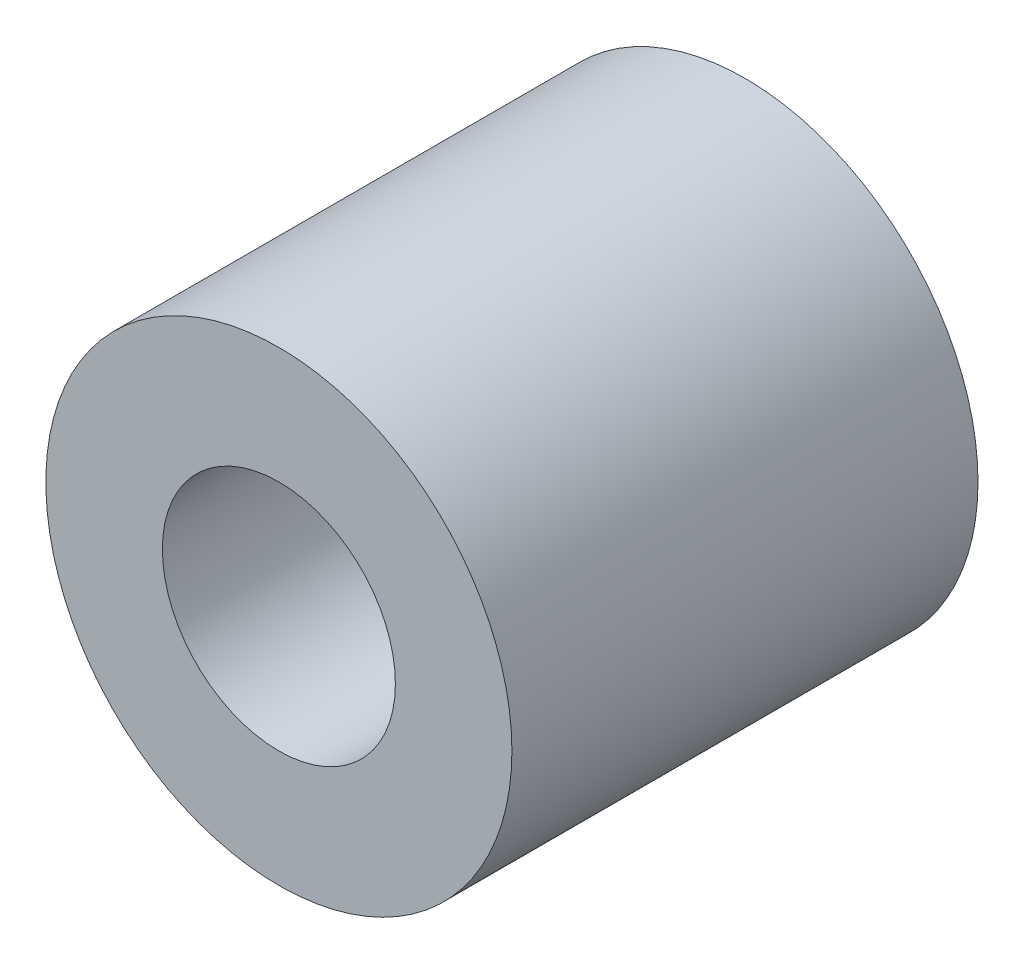
ISO-10303-21;
HEADER;
FILE_DESCRIPTION(('STEP AP214'),'2;1');
FILE_NAME('part.step','',(''),(''),'','','');
FILE_SCHEMA(('AUTOMOTIVE_DESIGN { 1 0 10303 214 1 1 1 1 }'));
ENDSEC;
DATA;
#1=APPLICATION_CONTEXT('core data for automotive mechanical design processes');
#2=APPLICATION_PROTOCOL_DEFINITION('international standard','automotive_design',2000,#1);
#3=PRODUCT_CONTEXT('',#1,'mechanical');
#4=PRODUCT('Part','Part','',(#3));
#5=PRODUCT_RELATED_PRODUCT_CATEGORY('part','',(#4));
#6=PRODUCT_DEFINITION_FORMATION('','',#4);
#7=PRODUCT_DEFINITION_CONTEXT('part definition',#1,'design');
#8=PRODUCT_DEFINITION('design','',#6,#7);
#9=PRODUCT_DEFINITION_SHAPE('','',#8);
#10=(LENGTH_UNIT() NAMED_UNIT(*) SI_UNIT(.MILLI.,.METRE.));
#11=(NAMED_UNIT(*) PLANE_ANGLE_UNIT() SI_UNIT($,.RADIAN.));
#12=(NAMED_UNIT(*) SI_UNIT($,.STERADIAN.) SOLID_ANGLE_UNIT());
#13=UNCERTAINTY_MEASURE_WITH_UNIT(LENGTH_MEASURE(1.E-05),#10,'distance_accuracy_value','');
#14=(GEOMETRIC_REPRESENTATION_CONTEXT(3) GLOBAL_UNCERTAINTY_ASSIGNED_CONTEXT((#13)) GLOBAL_UNIT_ASSIGNED_CONTEXT((#10,
#11,#12)) REPRESENTATION_CONTEXT('',''));
#15=CARTESIAN_POINT('',(0.,0.,0.));
#16=DIRECTION('',(0.,0.,1.));
#17=DIRECTION('',(1.,0.,0.));
#18=AXIS2_PLACEMENT_3D('',#15,#16,#17);
#19=CARTESIAN_POINT('',(16.35,-29.65,27.));
#20=DIRECTION('',(0.,0.,-1.));
#21=DIRECTION('',(-1.,0.,0.));
#22=AXIS2_PLACEMENT_3D('',#19,#20,#21);
#23=CYLINDRICAL_SURFACE('',#22,6.);
#24=CARTESIAN_POINT('',(16.35,-29.65,27.));
#25=DIRECTION('',(0.,0.,1.));
#26=DIRECTION('',(1.,0.,0.));
#27=AXIS2_PLACEMENT_3D('',#24,#25,#26);
#28=CIRCLE('',#27,6.);
#29=CARTESIAN_POINT('',(22.35,-29.65,27.));
#30=VERTEX_POINT('',#29);
#31=EDGE_CURVE('E11',#30,#30,#28,.T.);
#32=ORIENTED_EDGE('',*,*,#31,.F.);
#33=EDGE_LOOP('',(#32));
#34=FACE_BOUND('',#33,.T.);
#35=CARTESIAN_POINT('',(16.35,-29.65,15.));
#36=DIRECTION('',(0.,0.,1.));
#37=DIRECTION('',(1.,0.,0.));
#38=AXIS2_PLACEMENT_3D('',#35,#36,#37);
#39=CIRCLE('',#38,6.);
#40=CARTESIAN_POINT('',(22.35,-29.65,15.));
#41=VERTEX_POINT('',#40);
#42=EDGE_CURVE('E35',#41,#41,#39,.T.);
#43=ORIENTED_EDGE('',*,*,#42,.T.);
#44=EDGE_LOOP('',(#43));
#45=FACE_BOUND('',#44,.T.);
#46=ADVANCED_FACE('F32',(#34,#45),#23,.T.);
#47=CARTESIAN_POINT('',(16.35,-29.65,27.));
#48=DIRECTION('',(0.,0.,1.));
#49=DIRECTION('',(1.,0.,0.));
#50=AXIS2_PLACEMENT_3D('',#47,#48,#49);
#51=PLANE('',#50);
#52=CARTESIAN_POINT('',(16.35,-29.65,27.));
#53=DIRECTION('',(0.,0.,1.));
#54=DIRECTION('',(1.,0.,0.));
#55=AXIS2_PLACEMENT_3D('',#52,#53,#54);
#56=CIRCLE('',#55,3.);
#57=CARTESIAN_POINT('',(19.35,-29.65,27.));
#58=VERTEX_POINT('',#57);
#59=EDGE_CURVE('E69',#58,#58,#56,.T.);
#60=ORIENTED_EDGE('',*,*,#59,.F.);
#61=EDGE_LOOP('',(#60));
#62=FACE_BOUND('',#61,.T.);
#63=ORIENTED_EDGE('',*,*,#31,.T.);
#64=EDGE_LOOP('',(#63));
#65=FACE_BOUND('',#64,.T.);
#66=ADVANCED_FACE('F99',(#62,#65),#51,.T.);
#67=CARTESIAN_POINT('',(16.35,-29.65,15.));
#68=DIRECTION('',(0.,0.,1.));
#69=DIRECTION('',(1.,0.,0.));
#70=AXIS2_PLACEMENT_3D('',#67,#68,#69);
#71=PLANE('',#70);
#72=DIRECTION('',(0.,-1.,0.));
#73=VECTOR('',#72,1.);
#74=CARTESIAN_POINT('',(18.35,-32.0185438564654,15.));
#75=LINE('',#74,#73);
#76=CARTESIAN_POINT('',(18.35,-27.2814561435346,15.));
#77=VERTEX_POINT('',#76);
#78=CARTESIAN_POINT('',(18.35,-32.0185438564654,15.));
#79=VERTEX_POINT('',#78);
#80=EDGE_CURVE('E93',#77,#79,#75,.T.);
#81=ORIENTED_EDGE('',*,*,#80,.F.);
#82=CARTESIAN_POINT('',(16.35,-29.65,15.));
#83=DIRECTION('',(0.,0.,-1.));
#84=DIRECTION('',(-1.,0.,0.));
#85=AXIS2_PLACEMENT_3D('',#82,#83,#84);
#86=CIRCLE('',#85,3.1);
#87=EDGE_CURVE('E53',#79,#77,#86,.T.);
#88=ORIENTED_EDGE('',*,*,#87,.F.);
#89=EDGE_LOOP('',(#81,#88));
#90=FACE_BOUND('',#89,.T.);
#91=ORIENTED_EDGE('',*,*,#42,.F.);
#92=EDGE_LOOP('',(#91));
#93=FACE_BOUND('',#92,.T.);
#94=ADVANCED_FACE('F102',(#90,#93),#71,.F.);
#95=CARTESIAN_POINT('',(16.35,-29.65,21.));
#96=DIRECTION('',(0.,0.,-1.));
#97=DIRECTION('',(-1.,0.,0.));
#98=AXIS2_PLACEMENT_3D('',#95,#96,#97);
#99=CYLINDRICAL_SURFACE('',#98,3.1);
#100=ORIENTED_EDGE('',*,*,#87,.T.);
#101=DIRECTION('',(0.,0.,-1.));
#102=VECTOR('',#101,1.);
#103=CARTESIAN_POINT('',(18.35,-27.2814561435346,21.));
#104=LINE('',#103,#102);
#105=CARTESIAN_POINT('',(18.35,-27.2814561435346,21.));
#106=VERTEX_POINT('',#105);
#107=EDGE_CURVE('E88',#106,#77,#104,.T.);
#108=ORIENTED_EDGE('',*,*,#107,.F.);
#109=CARTESIAN_POINT('',(16.35,-29.65,21.));
#110=DIRECTION('',(0.,0.,-1.));
#111=DIRECTION('',(-1.,0.,0.));
#112=AXIS2_PLACEMENT_3D('',#109,#110,#111);
#113=CIRCLE('',#112,3.1);
#114=CARTESIAN_POINT('',(18.35,-32.0185438564654,21.));
#115=VERTEX_POINT('',#114);
#116=EDGE_CURVE('E87',#115,#106,#113,.T.);
#117=ORIENTED_EDGE('',*,*,#116,.F.);
#118=DIRECTION('',(0.,0.,-1.));
#119=VECTOR('',#118,1.);
#120=CARTESIAN_POINT('',(18.35,-32.0185438564654,21.));
#121=LINE('',#120,#119);
#122=EDGE_CURVE('E89',#115,#79,#121,.T.);
#123=ORIENTED_EDGE('',*,*,#122,.T.);
#124=EDGE_LOOP('',(#100,#108,#117,#123));
#125=FACE_BOUND('',#124,.T.);
#126=ADVANCED_FACE('F112',(#125),#99,.F.);
#127=CARTESIAN_POINT('',(18.35,-32.0185438564654,21.));
#128=DIRECTION('',(1.,0.,0.));
#129=DIRECTION('',(0.,1.,0.));
#130=AXIS2_PLACEMENT_3D('',#127,#128,#129);
#131=PLANE('',#130);
#132=ORIENTED_EDGE('',*,*,#80,.T.);
#133=ORIENTED_EDGE('',*,*,#122,.F.);
#134=DIRECTION('',(0.,-1.,0.));
#135=VECTOR('',#134,1.);
#136=CARTESIAN_POINT('',(18.35,-32.0185438564654,21.));
#137=LINE('',#136,#135);
#138=CARTESIAN_POINT('',(18.35,-31.8860679774998,21.));
#139=VERTEX_POINT('',#138);
#140=EDGE_CURVE('E82',#139,#115,#137,.T.);
#141=ORIENTED_EDGE('',*,*,#140,.F.);
#142=CARTESIAN_POINT('',(18.35,-27.4139320225002,21.));
#143=VERTEX_POINT('',#142);
#144=EDGE_CURVE('E66',#143,#139,#137,.T.);
#145=ORIENTED_EDGE('',*,*,#144,.F.);
#146=EDGE_CURVE('E80',#106,#143,#137,.T.);
#147=ORIENTED_EDGE('',*,*,#146,.F.);
#148=ORIENTED_EDGE('',*,*,#107,.T.);
#149=EDGE_LOOP('',(#132,#133,#141,#145,#147,#148));
#150=FACE_BOUND('',#149,.T.);
#151=ADVANCED_FACE('F79',(#150),#131,.F.);
#152=CARTESIAN_POINT('',(16.35,-29.65,21.));
#153=DIRECTION('',(0.,0.,-1.));
#154=DIRECTION('',(-1.,0.,0.));
#155=AXIS2_PLACEMENT_3D('',#152,#153,#154);
#156=PLANE('',#155);
#157=ORIENTED_EDGE('',*,*,#146,.T.);
#158=CARTESIAN_POINT('',(16.35,-29.65,21.));
#159=DIRECTION('',(0.,0.,1.));
#160=DIRECTION('',(1.,0.,0.));
#161=AXIS2_PLACEMENT_3D('',#158,#159,#160);
#162=CIRCLE('',#161,3.);
#163=EDGE_CURVE('E68',#143,#139,#162,.T.);
#164=ORIENTED_EDGE('',*,*,#163,.T.);
#165=ORIENTED_EDGE('',*,*,#140,.T.);
#166=ORIENTED_EDGE('',*,*,#116,.T.);
#167=EDGE_LOOP('',(#157,#164,#165,#166));
#168=FACE_BOUND('',#167,.T.);
#169=ADVANCED_FACE('F85',(#168),#156,.T.);
#170=CARTESIAN_POINT('',(16.35,-29.65,21.));
#171=DIRECTION('',(0.,0.,1.));
#172=DIRECTION('',(1.,0.,0.));
#173=AXIS2_PLACEMENT_3D('',#170,#171,#172);
#174=PLANE('',#173);
#175=ORIENTED_EDGE('',*,*,#144,.T.);
#176=EDGE_CURVE('E45',#139,#143,#162,.T.);
#177=ORIENTED_EDGE('',*,*,#176,.T.);
#178=EDGE_LOOP('',(#175,#177));
#179=FACE_BOUND('',#178,.T.);
#180=ADVANCED_FACE('F64',(#179),#174,.T.);
#181=CARTESIAN_POINT('',(16.35,-29.65,21.));
#182=DIRECTION('',(0.,0.,1.));
#183=DIRECTION('',(1.,0.,0.));
#184=AXIS2_PLACEMENT_3D('',#181,#182,#183);
#185=CYLINDRICAL_SURFACE('',#184,3.);
#186=ORIENTED_EDGE('',*,*,#163,.F.);
#187=ORIENTED_EDGE('',*,*,#176,.F.);
#188=EDGE_LOOP('',(#186,#187));
#189=FACE_BOUND('',#188,.T.);
#190=ORIENTED_EDGE('',*,*,#59,.T.);
#191=EDGE_LOOP('',(#190));
#192=FACE_BOUND('',#191,.T.);
#193=ADVANCED_FACE('F71',(#189,#192),#185,.F.);
#194=CLOSED_SHELL('',(#46,#66,#94,#126,#151,#169,#180,#193));
#195=MANIFOLD_SOLID_BREP('B2',#194);
#196=ADVANCED_BREP_SHAPE_REPRESENTATION('',(#18,#195),#14);
#197=SHAPE_DEFINITION_REPRESENTATION(#9,#196);
ENDSEC;
END-ISO-10303-21;
